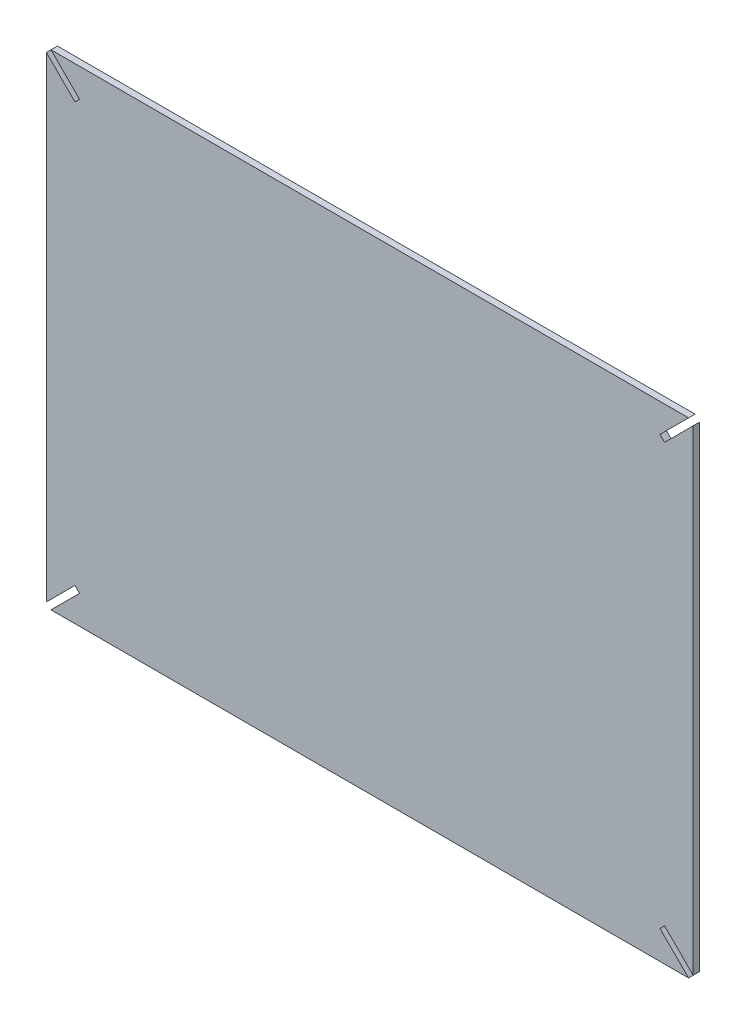
ISO-10303-21;
HEADER;
FILE_DESCRIPTION(('STEP AP214'),'2;1');
FILE_NAME('part.step','',(''),(''),'','','');
FILE_SCHEMA(('AUTOMOTIVE_DESIGN { 1 0 10303 214 1 1 1 1 }'));
ENDSEC;
DATA;
#1=APPLICATION_CONTEXT('core data for automotive mechanical design processes');
#2=APPLICATION_PROTOCOL_DEFINITION('international standard','automotive_design',2000,#1);
#3=PRODUCT_CONTEXT('',#1,'mechanical');
#4=PRODUCT('Part','Part','',(#3));
#5=PRODUCT_RELATED_PRODUCT_CATEGORY('part','',(#4));
#6=PRODUCT_DEFINITION_FORMATION('','',#4);
#7=PRODUCT_DEFINITION_CONTEXT('part definition',#1,'design');
#8=PRODUCT_DEFINITION('design','',#6,#7);
#9=PRODUCT_DEFINITION_SHAPE('','',#8);
#10=(LENGTH_UNIT() NAMED_UNIT(*) SI_UNIT(.MILLI.,.METRE.));
#11=(NAMED_UNIT(*) PLANE_ANGLE_UNIT() SI_UNIT($,.RADIAN.));
#12=(NAMED_UNIT(*) SI_UNIT($,.STERADIAN.) SOLID_ANGLE_UNIT());
#13=UNCERTAINTY_MEASURE_WITH_UNIT(LENGTH_MEASURE(1.E-05),#10,'distance_accuracy_value','');
#14=(GEOMETRIC_REPRESENTATION_CONTEXT(3) GLOBAL_UNCERTAINTY_ASSIGNED_CONTEXT((#13)) GLOBAL_UNIT_ASSIGNED_CONTEXT((#10,
#11,#12)) REPRESENTATION_CONTEXT('',''));
#15=CARTESIAN_POINT('',(0.,0.,0.));
#16=DIRECTION('',(0.,0.,1.));
#17=DIRECTION('',(1.,0.,0.));
#18=AXIS2_PLACEMENT_3D('',#15,#16,#17);
#19=CARTESIAN_POINT('',(-435.113026762588,131.24911261966,4.));
#20=DIRECTION('',(0.707106781186551,0.707106781186544,0.));
#21=DIRECTION('',(-0.707106781186544,0.707106781186551,0.));
#22=AXIS2_PLACEMENT_3D('',#19,#20,#21);
#23=PLANE('',#22);
#24=DIRECTION('',(0.707106781186544,-0.707106781186551,0.));
#25=VECTOR('',#24,1.);
#26=CARTESIAN_POINT('',(-435.113026762588,131.24911261966,0.));
#27=LINE('',#26,#25);
#28=CARTESIAN_POINT('',(-435.113026762588,131.24911261966,0.));
#29=VERTEX_POINT('',#28);
#30=CARTESIAN_POINT('',(-417.435357232924,113.571443089997,0.));
#31=VERTEX_POINT('',#30);
#32=EDGE_CURVE('E175',#29,#31,#27,.T.);
#33=ORIENTED_EDGE('',*,*,#32,.T.);
#34=DIRECTION('',(0.,0.,-1.));
#35=VECTOR('',#34,1.);
#36=CARTESIAN_POINT('',(-417.435357232924,113.571443089997,4.));
#37=LINE('',#36,#35);
#38=CARTESIAN_POINT('',(-417.435357232924,113.571443089997,4.));
#39=VERTEX_POINT('',#38);
#40=EDGE_CURVE('E11',#39,#31,#37,.T.);
#41=ORIENTED_EDGE('',*,*,#40,.F.);
#42=DIRECTION('',(0.707106781186544,-0.707106781186551,0.));
#43=VECTOR('',#42,1.);
#44=CARTESIAN_POINT('',(-435.113026762588,131.24911261966,4.));
#45=LINE('',#44,#43);
#46=CARTESIAN_POINT('',(-435.113026762588,131.24911261966,4.));
#47=VERTEX_POINT('',#46);
#48=EDGE_CURVE('E205',#47,#39,#45,.T.);
#49=ORIENTED_EDGE('',*,*,#48,.F.);
#50=DIRECTION('',(0.,0.,-1.));
#51=VECTOR('',#50,1.);
#52=CARTESIAN_POINT('',(-435.113026762588,131.24911261966,4.));
#53=LINE('',#52,#51);
#54=EDGE_CURVE('E171',#47,#29,#53,.T.);
#55=ORIENTED_EDGE('',*,*,#54,.T.);
#56=EDGE_LOOP('',(#33,#41,#49,#55));
#57=FACE_BOUND('',#56,.T.);
#58=ADVANCED_FACE('F31',(#57),#23,.F.);
#59=CARTESIAN_POINT('',(-417.435357232924,113.571443089997,4.));
#60=DIRECTION('',(0.707106781186546,-0.707106781186549,0.));
#61=DIRECTION('',(0.707106781186549,0.707106781186546,0.));
#62=AXIS2_PLACEMENT_3D('',#59,#60,#61);
#63=PLANE('',#62);
#64=DIRECTION('',(-0.707106781186549,-0.707106781186546,0.));
#65=VECTOR('',#64,1.);
#66=CARTESIAN_POINT('',(-417.435357232924,113.571443089997,0.));
#67=LINE('',#66,#65);
#68=CARTESIAN_POINT('',(-420.263784357671,110.74301596525,0.));
#69=VERTEX_POINT('',#68);
#70=EDGE_CURVE('E178',#31,#69,#67,.T.);
#71=ORIENTED_EDGE('',*,*,#70,.T.);
#72=DIRECTION('',(0.,0.,-1.));
#73=VECTOR('',#72,1.);
#74=CARTESIAN_POINT('',(-420.263784357671,110.74301596525,4.));
#75=LINE('',#74,#73);
#76=CARTESIAN_POINT('',(-420.263784357671,110.74301596525,4.));
#77=VERTEX_POINT('',#76);
#78=EDGE_CURVE('E39',#77,#69,#75,.T.);
#79=ORIENTED_EDGE('',*,*,#78,.F.);
#80=DIRECTION('',(-0.707106781186549,-0.707106781186546,0.));
#81=VECTOR('',#80,1.);
#82=CARTESIAN_POINT('',(-417.435357232924,113.571443089997,4.));
#83=LINE('',#82,#81);
#84=EDGE_CURVE('E114',#39,#77,#83,.T.);
#85=ORIENTED_EDGE('',*,*,#84,.F.);
#86=ORIENTED_EDGE('',*,*,#40,.T.);
#87=EDGE_LOOP('',(#71,#79,#85,#86));
#88=FACE_BOUND('',#87,.T.);
#89=ADVANCED_FACE('F303',(#88),#63,.F.);
#90=CARTESIAN_POINT('',(-420.263784357671,110.74301596525,4.));
#91=DIRECTION('',(-0.707106781186551,-0.707106781186544,0.));
#92=DIRECTION('',(0.707106781186544,-0.707106781186551,0.));
#93=AXIS2_PLACEMENT_3D('',#90,#91,#92);
#94=PLANE('',#93);
#95=DIRECTION('',(-0.707106781186544,0.707106781186551,0.));
#96=VECTOR('',#95,1.);
#97=CARTESIAN_POINT('',(-420.263784357671,110.74301596525,0.));
#98=LINE('',#97,#96);
#99=CARTESIAN_POINT('',(-437.941453887334,128.420685494914,0.));
#100=VERTEX_POINT('',#99);
#101=EDGE_CURVE('E180',#69,#100,#98,.T.);
#102=ORIENTED_EDGE('',*,*,#101,.T.);
#103=DIRECTION('',(0.,0.,-1.));
#104=VECTOR('',#103,1.);
#105=CARTESIAN_POINT('',(-437.941453887334,128.420685494914,4.));
#106=LINE('',#105,#104);
#107=CARTESIAN_POINT('',(-437.941453887334,128.420685494914,4.));
#108=VERTEX_POINT('',#107);
#109=EDGE_CURVE('E236',#108,#100,#106,.T.);
#110=ORIENTED_EDGE('',*,*,#109,.F.);
#111=DIRECTION('',(-0.707106781186544,0.707106781186551,0.));
#112=VECTOR('',#111,1.);
#113=CARTESIAN_POINT('',(-420.263784357671,110.74301596525,4.));
#114=LINE('',#113,#112);
#115=EDGE_CURVE('E244',#77,#108,#114,.T.);
#116=ORIENTED_EDGE('',*,*,#115,.F.);
#117=ORIENTED_EDGE('',*,*,#78,.T.);
#118=EDGE_LOOP('',(#102,#110,#116,#117));
#119=FACE_BOUND('',#118,.T.);
#120=ADVANCED_FACE('F242',(#119),#94,.F.);
#121=CARTESIAN_POINT('',(-437.941453887334,128.420685494914,4.));
#122=DIRECTION('',(1.,0.,0.));
#123=DIRECTION('',(0.,1.,0.));
#124=AXIS2_PLACEMENT_3D('',#121,#122,#123);
#125=PLANE('',#124);
#126=DIRECTION('',(0.,-1.,0.));
#127=VECTOR('',#126,1.);
#128=CARTESIAN_POINT('',(-437.941453887334,128.420685494914,0.));
#129=LINE('',#128,#127);
#130=CARTESIAN_POINT('',(-437.941453887335,-165.922460255593,0.));
#131=VERTEX_POINT('',#130);
#132=EDGE_CURVE('E182',#100,#131,#129,.T.);
#133=ORIENTED_EDGE('',*,*,#132,.T.);
#134=DIRECTION('',(0.,0.,-1.));
#135=VECTOR('',#134,1.);
#136=CARTESIAN_POINT('',(-437.941453887335,-165.922460255593,4.));
#137=LINE('',#136,#135);
#138=CARTESIAN_POINT('',(-437.941453887335,-165.922460255593,4.));
#139=VERTEX_POINT('',#138);
#140=EDGE_CURVE('E233',#139,#131,#137,.T.);
#141=ORIENTED_EDGE('',*,*,#140,.F.);
#142=DIRECTION('',(0.,-1.,0.));
#143=VECTOR('',#142,1.);
#144=CARTESIAN_POINT('',(-437.941453887334,128.420685494914,4.));
#145=LINE('',#144,#143);
#146=EDGE_CURVE('E262',#108,#139,#145,.T.);
#147=ORIENTED_EDGE('',*,*,#146,.F.);
#148=ORIENTED_EDGE('',*,*,#109,.T.);
#149=EDGE_LOOP('',(#133,#141,#147,#148));
#150=FACE_BOUND('',#149,.T.);
#151=ADVANCED_FACE('F253',(#150),#125,.F.);
#152=CARTESIAN_POINT('',(-420.263784357671,-148.24479072593,4.));
#153=DIRECTION('',(-0.707106781186548,0.707106781186547,0.));
#154=DIRECTION('',(-0.707106781186547,-0.707106781186548,0.));
#155=AXIS2_PLACEMENT_3D('',#152,#153,#154);
#156=PLANE('',#155);
#157=DIRECTION('',(0.707106781186547,0.707106781186548,0.));
#158=VECTOR('',#157,1.);
#159=CARTESIAN_POINT('',(-420.263784357671,-148.24479072593,0.));
#160=LINE('',#159,#158);
#161=CARTESIAN_POINT('',(-420.263784357671,-148.24479072593,0.));
#162=VERTEX_POINT('',#161);
#163=EDGE_CURVE('E184',#131,#162,#160,.T.);
#164=ORIENTED_EDGE('',*,*,#163,.T.);
#165=DIRECTION('',(0.,0.,-1.));
#166=VECTOR('',#165,1.);
#167=CARTESIAN_POINT('',(-420.263784357671,-148.24479072593,4.));
#168=LINE('',#167,#166);
#169=CARTESIAN_POINT('',(-420.263784357671,-148.24479072593,4.));
#170=VERTEX_POINT('',#169);
#171=EDGE_CURVE('E230',#170,#162,#168,.T.);
#172=ORIENTED_EDGE('',*,*,#171,.F.);
#173=DIRECTION('',(0.707106781186547,0.707106781186548,0.));
#174=VECTOR('',#173,1.);
#175=CARTESIAN_POINT('',(-420.263784357671,-148.24479072593,4.));
#176=LINE('',#175,#174);
#177=EDGE_CURVE('E259',#139,#170,#176,.T.);
#178=ORIENTED_EDGE('',*,*,#177,.F.);
#179=ORIENTED_EDGE('',*,*,#140,.T.);
#180=EDGE_LOOP('',(#164,#172,#178,#179));
#181=FACE_BOUND('',#180,.T.);
#182=ADVANCED_FACE('F257',(#181),#156,.F.);
#183=CARTESIAN_POINT('',(-417.435357232925,-151.073217850676,4.));
#184=DIRECTION('',(0.707106781186551,0.707106781186544,0.));
#185=DIRECTION('',(-0.707106781186544,0.707106781186551,0.));
#186=AXIS2_PLACEMENT_3D('',#183,#184,#185);
#187=PLANE('',#186);
#188=DIRECTION('',(0.707106781186544,-0.707106781186551,0.));
#189=VECTOR('',#188,1.);
#190=CARTESIAN_POINT('',(-417.435357232925,-151.073217850676,0.));
#191=LINE('',#190,#189);
#192=CARTESIAN_POINT('',(-417.435357232925,-151.073217850676,0.));
#193=VERTEX_POINT('',#192);
#194=EDGE_CURVE('E186',#162,#193,#191,.T.);
#195=ORIENTED_EDGE('',*,*,#194,.T.);
#196=DIRECTION('',(0.,0.,-1.));
#197=VECTOR('',#196,1.);
#198=CARTESIAN_POINT('',(-417.435357232925,-151.073217850676,4.));
#199=LINE('',#198,#197);
#200=CARTESIAN_POINT('',(-417.435357232925,-151.073217850676,4.));
#201=VERTEX_POINT('',#200);
#202=EDGE_CURVE('E227',#201,#193,#199,.T.);
#203=ORIENTED_EDGE('',*,*,#202,.F.);
#204=DIRECTION('',(0.707106781186544,-0.707106781186551,0.));
#205=VECTOR('',#204,1.);
#206=CARTESIAN_POINT('',(-417.435357232925,-151.073217850676,4.));
#207=LINE('',#206,#205);
#208=EDGE_CURVE('E261',#170,#201,#207,.T.);
#209=ORIENTED_EDGE('',*,*,#208,.F.);
#210=ORIENTED_EDGE('',*,*,#171,.T.);
#211=EDGE_LOOP('',(#195,#203,#209,#210));
#212=FACE_BOUND('',#211,.T.);
#213=ADVANCED_FACE('F316',(#212),#187,.F.);
#214=CARTESIAN_POINT('',(-435.113026762588,-168.75088738034,4.));
#215=DIRECTION('',(0.707106781186549,-0.707106781186546,0.));
#216=DIRECTION('',(0.707106781186546,0.707106781186549,0.));
#217=AXIS2_PLACEMENT_3D('',#214,#215,#216);
#218=PLANE('',#217);
#219=DIRECTION('',(-0.707106781186546,-0.707106781186549,0.));
#220=VECTOR('',#219,1.);
#221=CARTESIAN_POINT('',(-435.113026762588,-168.75088738034,0.));
#222=LINE('',#221,#220);
#223=CARTESIAN_POINT('',(-435.113026762588,-168.75088738034,0.));
#224=VERTEX_POINT('',#223);
#225=EDGE_CURVE('E188',#193,#224,#222,.T.);
#226=ORIENTED_EDGE('',*,*,#225,.T.);
#227=DIRECTION('',(0.,0.,-1.));
#228=VECTOR('',#227,1.);
#229=CARTESIAN_POINT('',(-435.113026762588,-168.75088738034,4.));
#230=LINE('',#229,#228);
#231=CARTESIAN_POINT('',(-435.113026762588,-168.75088738034,4.));
#232=VERTEX_POINT('',#231);
#233=EDGE_CURVE('E224',#232,#224,#230,.T.);
#234=ORIENTED_EDGE('',*,*,#233,.F.);
#235=DIRECTION('',(-0.707106781186546,-0.707106781186549,0.));
#236=VECTOR('',#235,1.);
#237=CARTESIAN_POINT('',(-435.113026762588,-168.75088738034,4.));
#238=LINE('',#237,#236);
#239=EDGE_CURVE('E264',#201,#232,#238,.T.);
#240=ORIENTED_EDGE('',*,*,#239,.F.);
#241=ORIENTED_EDGE('',*,*,#202,.T.);
#242=EDGE_LOOP('',(#226,#234,#240,#241));
#243=FACE_BOUND('',#242,.T.);
#244=ADVANCED_FACE('F319',(#243),#218,.F.);
#245=CARTESIAN_POINT('',(-435.113026762588,-168.75088738034,4.));
#246=DIRECTION('',(0.,1.,0.));
#247=DIRECTION('',(-1.,0.,0.));
#248=AXIS2_PLACEMENT_3D('',#245,#246,#247);
#249=PLANE('',#248);
#250=DIRECTION('',(1.,0.,0.));
#251=VECTOR('',#250,1.);
#252=CARTESIAN_POINT('',(-435.113026762588,-168.75088738034,0.));
#253=LINE('',#252,#251);
#254=CARTESIAN_POINT('',(-40.7698810120805,-168.75088738034,0.));
#255=VERTEX_POINT('',#254);
#256=EDGE_CURVE('E190',#224,#255,#253,.T.);
#257=ORIENTED_EDGE('',*,*,#256,.T.);
#258=DIRECTION('',(0.,0.,-1.));
#259=VECTOR('',#258,1.);
#260=CARTESIAN_POINT('',(-40.7698810120805,-168.75088738034,4.));
#261=LINE('',#260,#259);
#262=CARTESIAN_POINT('',(-40.7698810120805,-168.75088738034,4.));
#263=VERTEX_POINT('',#262);
#264=EDGE_CURVE('E221',#263,#255,#261,.T.);
#265=ORIENTED_EDGE('',*,*,#264,.F.);
#266=DIRECTION('',(1.,0.,0.));
#267=VECTOR('',#266,1.);
#268=CARTESIAN_POINT('',(-435.113026762588,-168.75088738034,4.));
#269=LINE('',#268,#267);
#270=EDGE_CURVE('E270',#232,#263,#269,.T.);
#271=ORIENTED_EDGE('',*,*,#270,.F.);
#272=ORIENTED_EDGE('',*,*,#233,.T.);
#273=EDGE_LOOP('',(#257,#265,#271,#272));
#274=FACE_BOUND('',#273,.T.);
#275=ADVANCED_FACE('F323',(#274),#249,.F.);
#276=CARTESIAN_POINT('',(-58.4475505417447,-151.073217850677,4.));
#277=DIRECTION('',(-0.707106781186538,-0.707106781186557,0.));
#278=DIRECTION('',(0.707106781186557,-0.707106781186538,0.));
#279=AXIS2_PLACEMENT_3D('',#276,#277,#278);
#280=PLANE('',#279);
#281=DIRECTION('',(-0.707106781186557,0.707106781186538,0.));
#282=VECTOR('',#281,1.);
#283=CARTESIAN_POINT('',(-58.4475505417447,-151.073217850677,0.));
#284=LINE('',#283,#282);
#285=CARTESIAN_POINT('',(-58.4475505417447,-151.073217850677,0.));
#286=VERTEX_POINT('',#285);
#287=EDGE_CURVE('E192',#255,#286,#284,.T.);
#288=ORIENTED_EDGE('',*,*,#287,.T.);
#289=DIRECTION('',(0.,0.,-1.));
#290=VECTOR('',#289,1.);
#291=CARTESIAN_POINT('',(-58.4475505417447,-151.073217850677,4.));
#292=LINE('',#291,#290);
#293=CARTESIAN_POINT('',(-58.4475505417447,-151.073217850677,4.));
#294=VERTEX_POINT('',#293);
#295=EDGE_CURVE('E218',#294,#286,#292,.T.);
#296=ORIENTED_EDGE('',*,*,#295,.F.);
#297=DIRECTION('',(-0.707106781186557,0.707106781186538,0.));
#298=VECTOR('',#297,1.);
#299=CARTESIAN_POINT('',(-58.4475505417447,-151.073217850677,4.));
#300=LINE('',#299,#298);
#301=EDGE_CURVE('E272',#263,#294,#300,.T.);
#302=ORIENTED_EDGE('',*,*,#301,.F.);
#303=ORIENTED_EDGE('',*,*,#264,.T.);
#304=EDGE_LOOP('',(#288,#296,#302,#303));
#305=FACE_BOUND('',#304,.T.);
#306=ADVANCED_FACE('F327',(#305),#280,.F.);
#307=CARTESIAN_POINT('',(-55.6191234169985,-148.244790725931,4.));
#308=DIRECTION('',(-0.707106781186548,0.707106781186547,0.));
#309=DIRECTION('',(-0.707106781186547,-0.707106781186548,0.));
#310=AXIS2_PLACEMENT_3D('',#307,#308,#309);
#311=PLANE('',#310);
#312=DIRECTION('',(0.707106781186547,0.707106781186548,0.));
#313=VECTOR('',#312,1.);
#314=CARTESIAN_POINT('',(-55.6191234169985,-148.244790725931,0.));
#315=LINE('',#314,#313);
#316=CARTESIAN_POINT('',(-55.6191234169985,-148.244790725931,0.));
#317=VERTEX_POINT('',#316);
#318=EDGE_CURVE('E194',#286,#317,#315,.T.);
#319=ORIENTED_EDGE('',*,*,#318,.T.);
#320=DIRECTION('',(0.,0.,-1.));
#321=VECTOR('',#320,1.);
#322=CARTESIAN_POINT('',(-55.6191234169985,-148.244790725931,4.));
#323=LINE('',#322,#321);
#324=CARTESIAN_POINT('',(-55.6191234169985,-148.244790725931,4.));
#325=VERTEX_POINT('',#324);
#326=EDGE_CURVE('E215',#325,#317,#323,.T.);
#327=ORIENTED_EDGE('',*,*,#326,.F.);
#328=DIRECTION('',(0.707106781186547,0.707106781186548,0.));
#329=VECTOR('',#328,1.);
#330=CARTESIAN_POINT('',(-55.6191234169985,-148.244790725931,4.));
#331=LINE('',#330,#329);
#332=EDGE_CURVE('E274',#294,#325,#331,.T.);
#333=ORIENTED_EDGE('',*,*,#332,.F.);
#334=ORIENTED_EDGE('',*,*,#295,.T.);
#335=EDGE_LOOP('',(#319,#327,#333,#334));
#336=FACE_BOUND('',#335,.T.);
#337=ADVANCED_FACE('F331',(#336),#311,.F.);
#338=CARTESIAN_POINT('',(-37.9414538873348,-165.922460255594,4.));
#339=DIRECTION('',(0.707106781186548,0.707106781186547,0.));
#340=DIRECTION('',(-0.707106781186547,0.707106781186548,0.));
#341=AXIS2_PLACEMENT_3D('',#338,#339,#340);
#342=PLANE('',#341);
#343=DIRECTION('',(0.707106781186547,-0.707106781186548,0.));
#344=VECTOR('',#343,1.);
#345=CARTESIAN_POINT('',(-37.9414538873348,-165.922460255594,0.));
#346=LINE('',#345,#344);
#347=CARTESIAN_POINT('',(-37.9414538873348,-165.922460255594,0.));
#348=VERTEX_POINT('',#347);
#349=EDGE_CURVE('E196',#317,#348,#346,.T.);
#350=ORIENTED_EDGE('',*,*,#349,.T.);
#351=DIRECTION('',(0.,0.,-1.));
#352=VECTOR('',#351,1.);
#353=CARTESIAN_POINT('',(-37.9414538873348,-165.922460255594,4.));
#354=LINE('',#353,#352);
#355=CARTESIAN_POINT('',(-37.9414538873348,-165.922460255594,4.));
#356=VERTEX_POINT('',#355);
#357=EDGE_CURVE('E212',#356,#348,#354,.T.);
#358=ORIENTED_EDGE('',*,*,#357,.F.);
#359=DIRECTION('',(0.707106781186547,-0.707106781186548,0.));
#360=VECTOR('',#359,1.);
#361=CARTESIAN_POINT('',(-37.9414538873348,-165.922460255594,4.));
#362=LINE('',#361,#360);
#363=EDGE_CURVE('E276',#325,#356,#362,.T.);
#364=ORIENTED_EDGE('',*,*,#363,.F.);
#365=ORIENTED_EDGE('',*,*,#326,.T.);
#366=EDGE_LOOP('',(#350,#358,#364,#365));
#367=FACE_BOUND('',#366,.T.);
#368=ADVANCED_FACE('F335',(#367),#342,.F.);
#369=CARTESIAN_POINT('',(-37.9414538873348,-165.922460255594,4.));
#370=DIRECTION('',(-1.,0.,0.));
#371=DIRECTION('',(0.,-1.,0.));
#372=AXIS2_PLACEMENT_3D('',#369,#370,#371);
#373=PLANE('',#372);
#374=DIRECTION('',(0.,1.,0.));
#375=VECTOR('',#374,1.);
#376=CARTESIAN_POINT('',(-37.9414538873348,-165.922460255594,0.));
#377=LINE('',#376,#375);
#378=CARTESIAN_POINT('',(-37.9414538873343,128.420685494913,0.));
#379=VERTEX_POINT('',#378);
#380=EDGE_CURVE('E198',#348,#379,#377,.T.);
#381=ORIENTED_EDGE('',*,*,#380,.T.);
#382=DIRECTION('',(0.,0.,-1.));
#383=VECTOR('',#382,1.);
#384=CARTESIAN_POINT('',(-37.9414538873343,128.420685494913,4.));
#385=LINE('',#384,#383);
#386=CARTESIAN_POINT('',(-37.9414538873343,128.420685494913,4.));
#387=VERTEX_POINT('',#386);
#388=EDGE_CURVE('E209',#387,#379,#385,.T.);
#389=ORIENTED_EDGE('',*,*,#388,.F.);
#390=DIRECTION('',(0.,1.,0.));
#391=VECTOR('',#390,1.);
#392=CARTESIAN_POINT('',(-37.9414538873348,-165.922460255594,4.));
#393=LINE('',#392,#391);
#394=EDGE_CURVE('E278',#356,#387,#393,.T.);
#395=ORIENTED_EDGE('',*,*,#394,.F.);
#396=ORIENTED_EDGE('',*,*,#357,.T.);
#397=EDGE_LOOP('',(#381,#389,#395,#396));
#398=FACE_BOUND('',#397,.T.);
#399=ADVANCED_FACE('F284',(#398),#373,.F.);
#400=CARTESIAN_POINT('',(-37.9414538873343,128.420685494913,4.));
#401=DIRECTION('',(0.707106781186547,-0.707106781186548,0.));
#402=DIRECTION('',(0.707106781186548,0.707106781186547,0.));
#403=AXIS2_PLACEMENT_3D('',#400,#401,#402);
#404=PLANE('',#403);
#405=DIRECTION('',(-0.707106781186548,-0.707106781186547,0.));
#406=VECTOR('',#405,1.);
#407=CARTESIAN_POINT('',(-37.9414538873343,128.420685494913,0.));
#408=LINE('',#407,#406);
#409=CARTESIAN_POINT('',(-55.619123416998,110.74301596525,0.));
#410=VERTEX_POINT('',#409);
#411=EDGE_CURVE('E200',#379,#410,#408,.T.);
#412=ORIENTED_EDGE('',*,*,#411,.T.);
#413=DIRECTION('',(0.,0.,-1.));
#414=VECTOR('',#413,1.);
#415=CARTESIAN_POINT('',(-55.619123416998,110.74301596525,4.));
#416=LINE('',#415,#414);
#417=CARTESIAN_POINT('',(-55.619123416998,110.74301596525,4.));
#418=VERTEX_POINT('',#417);
#419=EDGE_CURVE('E166',#418,#410,#416,.T.);
#420=ORIENTED_EDGE('',*,*,#419,.F.);
#421=DIRECTION('',(-0.707106781186548,-0.707106781186547,0.));
#422=VECTOR('',#421,1.);
#423=CARTESIAN_POINT('',(-37.9414538873343,128.420685494913,4.));
#424=LINE('',#423,#422);
#425=EDGE_CURVE('E157',#387,#418,#424,.T.);
#426=ORIENTED_EDGE('',*,*,#425,.F.);
#427=ORIENTED_EDGE('',*,*,#388,.T.);
#428=EDGE_LOOP('',(#412,#420,#426,#427));
#429=FACE_BOUND('',#428,.T.);
#430=ADVANCED_FACE('F288',(#429),#404,.F.);
#431=CARTESIAN_POINT('',(-55.619123416998,110.74301596525,4.));
#432=DIRECTION('',(-0.707106781186547,-0.707106781186547,0.));
#433=DIRECTION('',(0.707106781186548,-0.707106781186548,0.));
#434=AXIS2_PLACEMENT_3D('',#431,#432,#433);
#435=PLANE('',#434);
#436=DIRECTION('',(-0.707106781186548,0.707106781186548,0.));
#437=VECTOR('',#436,1.);
#438=CARTESIAN_POINT('',(-55.619123416998,110.74301596525,0.));
#439=LINE('',#438,#437);
#440=CARTESIAN_POINT('',(-58.4475505417442,113.571443089996,0.));
#441=VERTEX_POINT('',#440);
#442=EDGE_CURVE('E165',#410,#441,#439,.T.);
#443=ORIENTED_EDGE('',*,*,#442,.T.);
#444=DIRECTION('',(0.,0.,-1.));
#445=VECTOR('',#444,1.);
#446=CARTESIAN_POINT('',(-58.4475505417442,113.571443089996,4.));
#447=LINE('',#446,#445);
#448=CARTESIAN_POINT('',(-58.4475505417442,113.571443089996,4.));
#449=VERTEX_POINT('',#448);
#450=EDGE_CURVE('E162',#449,#441,#447,.T.);
#451=ORIENTED_EDGE('',*,*,#450,.F.);
#452=DIRECTION('',(-0.707106781186548,0.707106781186548,0.));
#453=VECTOR('',#452,1.);
#454=CARTESIAN_POINT('',(-55.619123416998,110.74301596525,4.));
#455=LINE('',#454,#453);
#456=EDGE_CURVE('E151',#418,#449,#455,.T.);
#457=ORIENTED_EDGE('',*,*,#456,.F.);
#458=ORIENTED_EDGE('',*,*,#419,.T.);
#459=EDGE_LOOP('',(#443,#451,#457,#458));
#460=FACE_BOUND('',#459,.T.);
#461=ADVANCED_FACE('F163',(#460),#435,.F.);
#462=CARTESIAN_POINT('',(-58.4475505417442,113.571443089996,4.));
#463=DIRECTION('',(-0.707106781186548,0.707106781186547,0.));
#464=DIRECTION('',(-0.707106781186547,-0.707106781186548,0.));
#465=AXIS2_PLACEMENT_3D('',#462,#463,#464);
#466=PLANE('',#465);
#467=DIRECTION('',(0.707106781186547,0.707106781186548,0.));
#468=VECTOR('',#467,1.);
#469=CARTESIAN_POINT('',(-58.4475505417442,113.571443089996,0.));
#470=LINE('',#469,#468);
#471=CARTESIAN_POINT('',(-40.7698810120805,131.24911261966,0.));
#472=VERTEX_POINT('',#471);
#473=EDGE_CURVE('E100',#441,#472,#470,.T.);
#474=ORIENTED_EDGE('',*,*,#473,.T.);
#475=DIRECTION('',(0.,0.,-1.));
#476=VECTOR('',#475,1.);
#477=CARTESIAN_POINT('',(-40.7698810120805,131.24911261966,4.));
#478=LINE('',#477,#476);
#479=CARTESIAN_POINT('',(-40.7698810120805,131.24911261966,4.));
#480=VERTEX_POINT('',#479);
#481=EDGE_CURVE('E167',#480,#472,#478,.T.);
#482=ORIENTED_EDGE('',*,*,#481,.F.);
#483=DIRECTION('',(0.707106781186547,0.707106781186548,0.));
#484=VECTOR('',#483,1.);
#485=CARTESIAN_POINT('',(-58.4475505417442,113.571443089996,4.));
#486=LINE('',#485,#484);
#487=EDGE_CURVE('E155',#449,#480,#486,.T.);
#488=ORIENTED_EDGE('',*,*,#487,.F.);
#489=ORIENTED_EDGE('',*,*,#450,.T.);
#490=EDGE_LOOP('',(#474,#482,#488,#489));
#491=FACE_BOUND('',#490,.T.);
#492=ADVANCED_FACE('F169',(#491),#466,.F.);
#493=CARTESIAN_POINT('',(-435.113026762588,131.24911261966,4.));
#494=DIRECTION('',(0.,-1.,0.));
#495=DIRECTION('',(1.,0.,0.));
#496=AXIS2_PLACEMENT_3D('',#493,#494,#495);
#497=PLANE('',#496);
#498=DIRECTION('',(-1.,0.,0.));
#499=VECTOR('',#498,1.);
#500=CARTESIAN_POINT('',(-435.113026762588,131.24911261966,0.));
#501=LINE('',#500,#499);
#502=EDGE_CURVE('E106',#472,#29,#501,.T.);
#503=ORIENTED_EDGE('',*,*,#502,.T.);
#504=ORIENTED_EDGE('',*,*,#54,.F.);
#505=DIRECTION('',(-1.,0.,0.));
#506=VECTOR('',#505,1.);
#507=CARTESIAN_POINT('',(-435.113026762588,131.24911261966,4.));
#508=LINE('',#507,#506);
#509=EDGE_CURVE('E47',#480,#47,#508,.T.);
#510=ORIENTED_EDGE('',*,*,#509,.F.);
#511=ORIENTED_EDGE('',*,*,#481,.T.);
#512=EDGE_LOOP('',(#503,#504,#510,#511));
#513=FACE_BOUND('',#512,.T.);
#514=ADVANCED_FACE('F292',(#513),#497,.F.);
#515=CARTESIAN_POINT('',(-417.435357232924,113.571443089997,4.));
#516=DIRECTION('',(0.,0.,-1.));
#517=DIRECTION('',(-1.,0.,0.));
#518=AXIS2_PLACEMENT_3D('',#515,#516,#517);
#519=PLANE('',#518);
#520=ORIENTED_EDGE('',*,*,#48,.T.);
#521=ORIENTED_EDGE('',*,*,#84,.T.);
#522=ORIENTED_EDGE('',*,*,#115,.T.);
#523=ORIENTED_EDGE('',*,*,#146,.T.);
#524=ORIENTED_EDGE('',*,*,#177,.T.);
#525=ORIENTED_EDGE('',*,*,#208,.T.);
#526=ORIENTED_EDGE('',*,*,#239,.T.);
#527=ORIENTED_EDGE('',*,*,#270,.T.);
#528=ORIENTED_EDGE('',*,*,#301,.T.);
#529=ORIENTED_EDGE('',*,*,#332,.T.);
#530=ORIENTED_EDGE('',*,*,#363,.T.);
#531=ORIENTED_EDGE('',*,*,#394,.T.);
#532=ORIENTED_EDGE('',*,*,#425,.T.);
#533=ORIENTED_EDGE('',*,*,#456,.T.);
#534=ORIENTED_EDGE('',*,*,#487,.T.);
#535=ORIENTED_EDGE('',*,*,#509,.T.);
#536=EDGE_LOOP('',(#520,#521,#522,#523,#524,#525,#526,#527,#528,#529,#530,#531,#532,#533,#534,#535));
#537=FACE_BOUND('',#536,.T.);
#538=ADVANCED_FACE('F153',(#537),#519,.F.);
#539=CARTESIAN_POINT('',(-417.435357232924,113.571443089997,0.));
#540=DIRECTION('',(0.,0.,-1.));
#541=DIRECTION('',(-1.,0.,0.));
#542=AXIS2_PLACEMENT_3D('',#539,#540,#541);
#543=PLANE('',#542);
#544=ORIENTED_EDGE('',*,*,#32,.F.);
#545=ORIENTED_EDGE('',*,*,#502,.F.);
#546=ORIENTED_EDGE('',*,*,#473,.F.);
#547=ORIENTED_EDGE('',*,*,#442,.F.);
#548=ORIENTED_EDGE('',*,*,#411,.F.);
#549=ORIENTED_EDGE('',*,*,#380,.F.);
#550=ORIENTED_EDGE('',*,*,#349,.F.);
#551=ORIENTED_EDGE('',*,*,#318,.F.);
#552=ORIENTED_EDGE('',*,*,#287,.F.);
#553=ORIENTED_EDGE('',*,*,#256,.F.);
#554=ORIENTED_EDGE('',*,*,#225,.F.);
#555=ORIENTED_EDGE('',*,*,#194,.F.);
#556=ORIENTED_EDGE('',*,*,#163,.F.);
#557=ORIENTED_EDGE('',*,*,#132,.F.);
#558=ORIENTED_EDGE('',*,*,#101,.F.);
#559=ORIENTED_EDGE('',*,*,#70,.F.);
#560=EDGE_LOOP('',(#544,#545,#546,#547,#548,#549,#550,#551,#552,#553,#554,#555,#556,#557,#558,#559));
#561=FACE_BOUND('',#560,.T.);
#562=ADVANCED_FACE('F248',(#561),#543,.T.);
#563=CLOSED_SHELL('',(#58,#89,#120,#151,#182,#213,#244,#275,#306,#337,#368,#399,#430,#461,#492,
#514,#538,#562));
#564=MANIFOLD_SOLID_BREP('B2',#563);
#565=ADVANCED_BREP_SHAPE_REPRESENTATION('',(#18,#564),#14);
#566=SHAPE_DEFINITION_REPRESENTATION(#9,#565);
ENDSEC;
END-ISO-10303-21;
